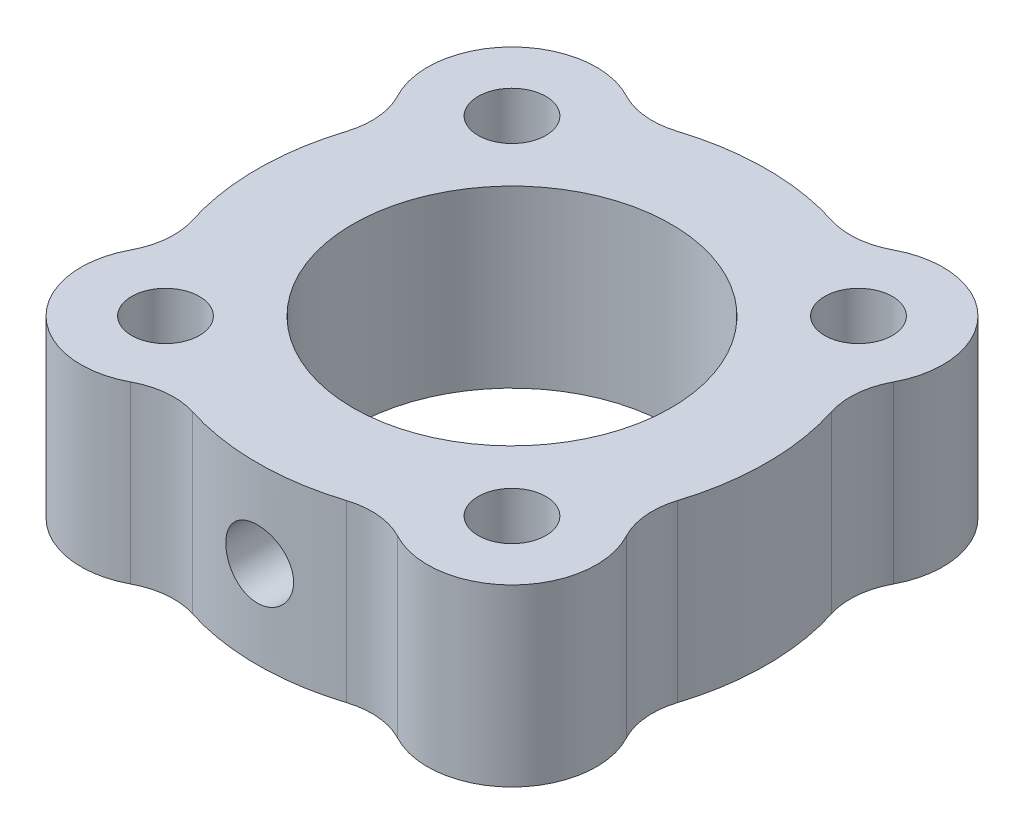
ISO-10303-21;
HEADER;
FILE_DESCRIPTION(('STEP AP214'),'2;1');
FILE_NAME('part.step','',(''),(''),'','','');
FILE_SCHEMA(('AUTOMOTIVE_DESIGN { 1 0 10303 214 1 1 1 1 }'));
ENDSEC;
DATA;
#1=APPLICATION_CONTEXT('core data for automotive mechanical design processes');
#2=APPLICATION_PROTOCOL_DEFINITION('international standard','automotive_design',2000,#1);
#3=PRODUCT_CONTEXT('',#1,'mechanical');
#4=PRODUCT('Part','Part','',(#3));
#5=PRODUCT_RELATED_PRODUCT_CATEGORY('part','',(#4));
#6=PRODUCT_DEFINITION_FORMATION('','',#4);
#7=PRODUCT_DEFINITION_CONTEXT('part definition',#1,'design');
#8=PRODUCT_DEFINITION('design','',#6,#7);
#9=PRODUCT_DEFINITION_SHAPE('','',#8);
#10=(LENGTH_UNIT() NAMED_UNIT(*) SI_UNIT(.MILLI.,.METRE.));
#11=(NAMED_UNIT(*) PLANE_ANGLE_UNIT() SI_UNIT($,.RADIAN.));
#12=(NAMED_UNIT(*) SI_UNIT($,.STERADIAN.) SOLID_ANGLE_UNIT());
#13=UNCERTAINTY_MEASURE_WITH_UNIT(LENGTH_MEASURE(1.E-05),#10,'distance_accuracy_value','');
#14=(GEOMETRIC_REPRESENTATION_CONTEXT(3) GLOBAL_UNCERTAINTY_ASSIGNED_CONTEXT((#13)) GLOBAL_UNIT_ASSIGNED_CONTEXT((#10,
#11,#12)) REPRESENTATION_CONTEXT('',''));
#15=CARTESIAN_POINT('',(0.,0.,0.));
#16=DIRECTION('',(0.,0.,1.));
#17=DIRECTION('',(1.,0.,0.));
#18=AXIS2_PLACEMENT_3D('',#15,#16,#17);
#19=CARTESIAN_POINT('',(3.95529126321616,9.525,-12.4686900684525));
#20=DIRECTION('',(0.,1.,0.));
#21=DIRECTION('',(0.,0.,1.));
#22=AXIS2_PLACEMENT_3D('',#19,#20,#21);
#23=CYLINDRICAL_SURFACE('',#22,2.921);
#24=CARTESIAN_POINT('',(3.95529126321616,2.54,-12.4686900684525));
#25=DIRECTION('',(0.,1.,0.));
#26=DIRECTION('',(0.,0.,1.));
#27=AXIS2_PLACEMENT_3D('',#24,#25,#26);
#28=CIRCLE('',#27,2.921);
#29=CARTESIAN_POINT('',(5.32895061805771,2.54,-9.89084193932303));
#30=VERTEX_POINT('',#29);
#31=CARTESIAN_POINT('',(3.07207088405138,2.54,-9.68441947064272));
#32=VERTEX_POINT('',#31);
#33=EDGE_CURVE('E127',#30,#32,#28,.F.);
#34=ORIENTED_EDGE('',*,*,#33,.T.);
#35=DIRECTION('',(0.,-1.,0.));
#36=VECTOR('',#35,1.);
#37=CARTESIAN_POINT('',(3.07207088405138,9.525,-9.68441947064272));
#38=LINE('',#37,#36);
#39=CARTESIAN_POINT('',(3.07207088405138,9.525,-9.68441947064272));
#40=VERTEX_POINT('',#39);
#41=EDGE_CURVE('E149',#40,#32,#38,.T.);
#42=ORIENTED_EDGE('',*,*,#41,.F.);
#43=CARTESIAN_POINT('',(3.95529126321616,9.525,-12.4686900684525));
#44=DIRECTION('',(0.,1.,0.));
#45=DIRECTION('',(0.,0.,1.));
#46=AXIS2_PLACEMENT_3D('',#43,#44,#45);
#47=CIRCLE('',#46,2.921);
#48=CARTESIAN_POINT('',(5.32895061805771,9.525,-9.89084193932303));
#49=VERTEX_POINT('',#48);
#50=EDGE_CURVE('E20',#49,#40,#47,.F.);
#51=ORIENTED_EDGE('',*,*,#50,.F.);
#52=DIRECTION('',(0.,-1.,0.));
#53=VECTOR('',#52,1.);
#54=CARTESIAN_POINT('',(5.32895061805771,9.525,-9.89084193932303));
#55=LINE('',#54,#53);
#56=EDGE_CURVE('E145',#30,#49,#55,.F.);
#57=ORIENTED_EDGE('',*,*,#56,.F.);
#58=EDGE_LOOP('',(#34,#42,#51,#57));
#59=FACE_BOUND('',#58,.T.);
#60=ADVANCED_FACE('F17',(#59),#23,.F.);
#61=CARTESIAN_POINT('',(-3.95529126321607,9.525,-12.4686900684525));
#62=DIRECTION('',(0.,1.,0.));
#63=DIRECTION('',(0.,0.,1.));
#64=AXIS2_PLACEMENT_3D('',#61,#62,#63);
#65=CYLINDRICAL_SURFACE('',#64,2.921);
#66=CARTESIAN_POINT('',(-3.95529126321607,2.54,-12.4686900684525));
#67=DIRECTION('',(0.,1.,0.));
#68=DIRECTION('',(0.,0.,1.));
#69=AXIS2_PLACEMENT_3D('',#66,#67,#68);
#70=CIRCLE('',#69,2.921);
#71=CARTESIAN_POINT('',(-3.07207088405131,2.54,-9.68441947064274));
#72=VERTEX_POINT('',#71);
#73=CARTESIAN_POINT('',(-5.32895061805764,2.54,-9.89084193932307));
#74=VERTEX_POINT('',#73);
#75=EDGE_CURVE('E140',#72,#74,#70,.F.);
#76=ORIENTED_EDGE('',*,*,#75,.T.);
#77=DIRECTION('',(0.,-1.,0.));
#78=VECTOR('',#77,1.);
#79=CARTESIAN_POINT('',(-5.32895061805764,9.525,-9.89084193932307));
#80=LINE('',#79,#78);
#81=CARTESIAN_POINT('',(-5.32895061805764,9.525,-9.89084193932307));
#82=VERTEX_POINT('',#81);
#83=EDGE_CURVE('E159',#82,#74,#80,.T.);
#84=ORIENTED_EDGE('',*,*,#83,.F.);
#85=CARTESIAN_POINT('',(-3.95529126321607,9.525,-12.4686900684525));
#86=DIRECTION('',(0.,1.,0.));
#87=DIRECTION('',(0.,0.,1.));
#88=AXIS2_PLACEMENT_3D('',#85,#86,#87);
#89=CIRCLE('',#88,2.921);
#90=CARTESIAN_POINT('',(-3.07207088405131,9.525,-9.68441947064274));
#91=VERTEX_POINT('',#90);
#92=EDGE_CURVE('E155',#91,#82,#89,.F.);
#93=ORIENTED_EDGE('',*,*,#92,.F.);
#94=DIRECTION('',(0.,-1.,0.));
#95=VECTOR('',#94,1.);
#96=CARTESIAN_POINT('',(-3.07207088405131,9.525,-9.68441947064274));
#97=LINE('',#96,#95);
#98=EDGE_CURVE('E327',#72,#91,#97,.F.);
#99=ORIENTED_EDGE('',*,*,#98,.F.);
#100=EDGE_LOOP('',(#76,#84,#93,#99));
#101=FACE_BOUND('',#100,.T.);
#102=ADVANCED_FACE('F325',(#101),#65,.F.);
#103=CARTESIAN_POINT('',(0.,6.0325,16.0437246383462));
#104=DIRECTION('',(0.,0.,1.));
#105=DIRECTION('',(1.,0.,0.));
#106=AXIS2_PLACEMENT_3D('',#103,#104,#105);
#107=CYLINDRICAL_SURFACE('',#106,1.35254999999999);
#108=CARTESIAN_POINT('',(0.,4.67995000000001,6.35));
#109=CARTESIAN_POINT('',(-0.0750471632780745,4.6799532589871,6.34999829109687));
#110=CARTESIAN_POINT('',(-0.150139225773979,4.68621853679149,6.34865568372771));
#111=CARTESIAN_POINT('',(-0.298207587506286,4.7110949818298,6.34342787909007));
#112=CARTESIAN_POINT('',(-0.371181675492682,4.7297185996608,6.33954011772078));
#113=CARTESIAN_POINT('',(-0.512832672049907,4.77870465532042,6.32965554088966));
#114=CARTESIAN_POINT('',(-0.581514247990421,4.80905407597117,6.32366106482182));
#115=CARTESIAN_POINT('',(-0.712800979699376,4.88059035043475,6.31021197910681));
#116=CARTESIAN_POINT('',(-0.775406879134115,4.92177587560618,6.30275754849689));
#117=CARTESIAN_POINT('',(-0.893727315084872,5.0144784654808,6.28707929813411));
#118=CARTESIAN_POINT('',(-0.949336446360758,5.0661285319522,6.27884638666341));
#119=CARTESIAN_POINT('',(-1.0511829388724,5.17802325922656,6.26260178305249));
#120=CARTESIAN_POINT('',(-1.09741749589304,5.23827048254082,6.25459015772276));
#121=CARTESIAN_POINT('',(-1.17966560546841,5.36643528003854,6.23960420880289));
#122=CARTESIAN_POINT('',(-1.2155628474068,5.43442896799417,6.23264207983407));
#123=CARTESIAN_POINT('',(-1.27534569830807,5.57561100854799,6.22068577239738));
#124=CARTESIAN_POINT('',(-1.29924508000965,5.64879329429422,6.21568933887547));
#125=CARTESIAN_POINT('',(-1.32864485681445,5.7740471277311,6.20945592466184));
#126=CARTESIAN_POINT('',(-1.33759487751569,5.82530106900315,6.20752588640034));
#127=CARTESIAN_POINT('',(-1.34954851058921,5.92852948877454,6.20493802773311));
#128=CARTESIAN_POINT('',(-1.35255227139075,5.98050394925582,6.20428017557135));
#129=CARTESIAN_POINT('',(-1.35254672259664,6.10752541368542,6.20428332563408));
#130=CARTESIAN_POINT('',(-1.34628495311372,6.18259577781737,6.20565750442881));
#131=CARTESIAN_POINT('',(-1.32142371189653,6.33061902207717,6.21099786105029));
#132=CARTESIAN_POINT('',(-1.30281171474536,6.40356967394338,6.21496667025208));
#133=CARTESIAN_POINT('',(-1.25385962676297,6.54517105269494,6.22502656373011));
#134=CARTESIAN_POINT('',(-1.22353309323969,6.61382664394816,6.23111519392307));
#135=CARTESIAN_POINT('',(-1.15205077466362,6.74506952506914,6.24472551077555));
#136=CARTESIAN_POINT('',(-1.11089626418825,6.807657527976,6.25224702873897));
#137=CARTESIAN_POINT('',(-1.01822556566802,6.925996833922,6.26801017783935));
#138=CARTESIAN_POINT('',(-0.966569407081304,6.98163737225314,6.27626058029602));
#139=CARTESIAN_POINT('',(-0.85464914252519,7.08354487063349,6.29247694544632));
#140=CARTESIAN_POINT('',(-0.794382558376484,7.12980912277652,6.30044282542318));
#141=CARTESIAN_POINT('',(-0.666199521654662,7.21208934606242,6.31528943073259));
#142=CARTESIAN_POINT('',(-0.598210285392906,7.24799418047066,6.32215805899767));
#143=CARTESIAN_POINT('',(-0.457037809009936,7.30779234051453,6.33392551804752));
#144=CARTESIAN_POINT('',(-0.383860587678284,7.33169933327395,6.33882658886009));
#145=CARTESIAN_POINT('',(-0.25858669301004,7.36111996252865,6.34493589793465));
#146=CARTESIAN_POINT('',(-0.207305867328812,7.37007937034924,6.3468254025267));
#147=CARTESIAN_POINT('',(-0.104023875136135,7.38204545024711,6.3493580315433));
#148=CARTESIAN_POINT('',(-0.0520227252073442,7.38505225913122,6.35000118461237));
#149=CARTESIAN_POINT('',(0.0750471632780732,7.3850467410129,6.34999829109687));
#150=CARTESIAN_POINT('',(0.150139225773978,7.37878146320851,6.34865568372771));
#151=CARTESIAN_POINT('',(0.298207587506285,7.3539050181702,6.34342787909007));
#152=CARTESIAN_POINT('',(0.371181675492681,7.3352814003392,6.33954011772078));
#153=CARTESIAN_POINT('',(0.512832672049906,7.28629534467958,6.32965554088966));
#154=CARTESIAN_POINT('',(0.58151424799042,7.25594592402883,6.32366106482182));
#155=CARTESIAN_POINT('',(0.712800979699375,7.18440964956525,6.31021197910681));
#156=CARTESIAN_POINT('',(0.775406879134114,7.14322412439382,6.30275754849689));
#157=CARTESIAN_POINT('',(0.893727315084872,7.0505215345192,6.28707929813411));
#158=CARTESIAN_POINT('',(0.949336446360758,6.9988714680478,6.27884638666341));
#159=CARTESIAN_POINT('',(1.0511829388724,6.88697674077344,6.26260178305249));
#160=CARTESIAN_POINT('',(1.09741749589304,6.82672951745918,6.25459015772276));
#161=CARTESIAN_POINT('',(1.17966560546841,6.69856471996146,6.23960420880289));
#162=CARTESIAN_POINT('',(1.2155628474068,6.63057103200583,6.23264207983407));
#163=CARTESIAN_POINT('',(1.27534569830807,6.48938899145201,6.22068577239738));
#164=CARTESIAN_POINT('',(1.29924508000965,6.41620670570578,6.21568933887547));
#165=CARTESIAN_POINT('',(1.32864485681445,6.2909528722689,6.20945592466184));
#166=CARTESIAN_POINT('',(1.33759487751569,6.23969893099684,6.20752588640034));
#167=CARTESIAN_POINT('',(1.34954851058921,6.13647051122545,6.20493802773311));
#168=CARTESIAN_POINT('',(1.35255227139075,6.08449605074417,6.20428017557135));
#169=CARTESIAN_POINT('',(1.35254672259664,5.95747458631458,6.20428332563408));
#170=CARTESIAN_POINT('',(1.34628495311372,5.88240422218263,6.20565750442881));
#171=CARTESIAN_POINT('',(1.32142371189653,5.73438097792283,6.21099786105029));
#172=CARTESIAN_POINT('',(1.30281171474536,5.66143032605662,6.21496667025208));
#173=CARTESIAN_POINT('',(1.25385962676297,5.51982894730506,6.22502656373011));
#174=CARTESIAN_POINT('',(1.22353309323969,5.45117335605184,6.23111519392307));
#175=CARTESIAN_POINT('',(1.15205077466361,5.31993047493086,6.24472551077555));
#176=CARTESIAN_POINT('',(1.11089626418825,5.257342472024,6.25224702873897));
#177=CARTESIAN_POINT('',(1.01822556566802,5.139003166078,6.26801017783935));
#178=CARTESIAN_POINT('',(0.966569407081304,5.08336262774686,6.27626058029602));
#179=CARTESIAN_POINT('',(0.85464914252519,4.98145512936651,6.29247694544632));
#180=CARTESIAN_POINT('',(0.794382558376484,4.93519087722348,6.30044282542318));
#181=CARTESIAN_POINT('',(0.666199521654662,4.85291065393758,6.31528943073259));
#182=CARTESIAN_POINT('',(0.598210285392906,4.81700581952934,6.32215805899767));
#183=CARTESIAN_POINT('',(0.457037809009936,4.75720765948547,6.33392551804752));
#184=CARTESIAN_POINT('',(0.383860587678284,4.73330066672605,6.33882658886009));
#185=CARTESIAN_POINT('',(0.258586693010039,4.70388003747135,6.34493589793465));
#186=CARTESIAN_POINT('',(0.207305867328812,4.69492062965076,6.3468254025267));
#187=CARTESIAN_POINT('',(0.104023875136134,4.68295454975289,6.3493580315433));
#188=CARTESIAN_POINT('',(0.052022725207343,4.67994774086878,6.35000118461237));
#189=CARTESIAN_POINT('',(0.,4.67995000000001,6.35));
#190=B_SPLINE_CURVE_WITH_KNOTS('',3,(#108,#109,#110,#111,#112,#113,#114,#115,#116,#117,#118,
#119,#120,#121,#122,#123,#124,#125,#126,#127,#128,#129,#130,#131,#132,#133,#134,#135,#136,#137,
#138,#139,#140,#141,#142,#143,#144,#145,#146,#147,#148,#149,#150,#151,#152,#153,#154,#155,#156,
#157,#158,#159,#160,#161,#162,#163,#164,#165,#166,#167,#168,#169,#170,#171,#172,#173,#174,#175,
#176,#177,#178,#179,#180,#181,#182,#183,#184,#185,#186,#187,#188,#189),.UNSPECIFIED.,.T.,.F.,(4,
2,2,2,2,2,2,2,2,2,2,2,2,2,2,2,2,2,2,2,2,2,2,2,2,2,2,2,2,2,2,2,2,2,2,2,2,2,2,2,4),(0.,
0.224949651136508,0.450126275982427,0.675053640209087,0.89995343838087,1.12791457201256,
1.35594379535309,1.58644652365364,1.81668404174771,1.97254305087209,2.12839816942854,
2.35328245539517,2.57839516495519,2.80324812692264,3.02807463294261,3.25612140277907,
3.48423393980881,3.71470970277065,3.94492232410781,4.1008611010001,4.25679629395604,
4.48174594509254,4.70692256993846,4.93184993416512,5.15674973233691,5.38471086596859,
5.61274008930912,5.84324281760967,6.07348033570375,6.22933934482812,6.38519446338458,
6.6100787493512,6.83519145891123,7.06004442087868,7.28487092689865,7.51291769673511,
7.74103023376484,7.97150599672669,8.20171861806385,8.35765739495613,8.51359258791207),.UNSPECIFIED.);
#191=CARTESIAN_POINT('',(0.,4.67995000000001,6.35));
#192=VERTEX_POINT('',#191);
#193=EDGE_CURVE('E139',#192,#192,#190,.T.);
#194=ORIENTED_EDGE('',*,*,#193,.T.);
#195=EDGE_LOOP('',(#194));
#196=FACE_BOUND('',#195,.T.);
#197=CARTESIAN_POINT('',(-1.35254999999999,6.0325,10.0695684365071));
#198=CARTESIAN_POINT('',(-1.3525466433626,6.10804129077537,10.0695696030717));
#199=CARTESIAN_POINT('',(-1.34619496016697,6.1836811159926,10.0704283580021));
#200=CARTESIAN_POINT('',(-1.32094489737387,6.33290614483726,10.0737709299998));
#201=CARTESIAN_POINT('',(-1.30202052621519,6.40648676237758,10.076258113368));
#202=CARTESIAN_POINT('',(-1.25219321734101,6.54933206190426,10.0825710232932));
#203=CARTESIAN_POINT('',(-1.22130353866668,6.61860142302363,10.0863952677658));
#204=CARTESIAN_POINT('',(-1.14844996295379,6.75094230979367,10.0949492946446));
#205=CARTESIAN_POINT('',(-1.1064905782915,6.81401634651805,10.0996787078592));
#206=CARTESIAN_POINT('',(-1.01239595918498,6.93261560865918,10.1095449249491));
#207=CARTESIAN_POINT('',(-0.960203544964528,6.98809529528744,10.1146839169908));
#208=CARTESIAN_POINT('',(-0.847245329726265,7.08953844573274,10.1247708328173));
#209=CARTESIAN_POINT('',(-0.786478659992263,7.1355009441329,10.1297187371769));
#210=CARTESIAN_POINT('',(-0.657817049082745,7.21676292160259,10.1388877742408));
#211=CARTESIAN_POINT('',(-0.58989629246305,7.25202186869218,10.1431061189586));
#212=CARTESIAN_POINT('',(-0.449032380940739,7.31061565938191,10.1503171312777));
#213=CARTESIAN_POINT('',(-0.376089480454125,7.33395110650916,10.1533098609138));
#214=CARTESIAN_POINT('',(-0.227710103177067,7.36790161554122,10.1577173481932));
#215=CARTESIAN_POINT('',(-0.152290971340383,7.37859126286711,10.1591413547638));
#216=CARTESIAN_POINT('',(-0.000716694266708818,7.38717800982287,10.1602825704962));
#217=CARTESIAN_POINT('',(0.075438419490393,7.38507565420379,10.1599998523392));
#218=CARTESIAN_POINT('',(0.225814183981001,7.36819760265153,10.1577669310844));
#219=CARTESIAN_POINT('',(0.300044030647495,7.35350224244173,10.1558272983419));
#220=CARTESIAN_POINT('',(0.444975242926539,7.31198084576055,10.1505102907647));
#221=CARTESIAN_POINT('',(0.515676503232885,7.28515444749373,10.1471328730497));
#222=CARTESIAN_POINT('',(0.651792135147238,7.22004698752602,10.1393014379308));
#223=CARTESIAN_POINT('',(0.71718963830435,7.18173106938673,10.1348441524857));
#224=CARTESIAN_POINT('',(0.840651601616256,7.09476088881498,10.1253515690495));
#225=CARTESIAN_POINT('',(0.898716268742608,7.04610691828126,10.1203162873803));
#226=CARTESIAN_POINT('',(1.00633250283049,6.9394022633579,10.110185175493));
#227=CARTESIAN_POINT('',(1.05581636189935,6.88128329266289,10.1050891753627));
#228=CARTESIAN_POINT('',(1.1443606283527,6.75749789328382,10.0954459962191));
#229=CARTESIAN_POINT('',(1.18341627360554,6.69182803594011,10.0908990684619));
#230=CARTESIAN_POINT('',(1.24999706842667,6.55472413700911,10.0828685400337));
#231=CARTESIAN_POINT('',(1.27750677453373,6.48328252657256,10.0793863652188));
#232=CARTESIAN_POINT('',(1.32006262264727,6.33683289868014,10.0739020332904));
#233=CARTESIAN_POINT('',(1.33513515214115,6.26183279079247,10.0718967437024));
#234=CARTESIAN_POINT('',(1.34670868483606,6.16067794129029,10.0703515224735));
#235=CARTESIAN_POINT('',(1.34889750231266,6.13509536629075,10.0700584793415));
#236=CARTESIAN_POINT('',(1.35181873076691,6.08384565611841,10.069666738036));
#237=CARTESIAN_POINT('',(1.35255114101152,6.05817852090305,10.0695680399604));
#238=CARTESIAN_POINT('',(1.3525466433626,5.95695870922463,10.0695696030717));
#239=CARTESIAN_POINT('',(1.34619496016698,5.8813188840074,10.0704283580021));
#240=CARTESIAN_POINT('',(1.32094489737387,5.73209385516274,10.0737709299998));
#241=CARTESIAN_POINT('',(1.30202052621519,5.65851323762242,10.076258113368));
#242=CARTESIAN_POINT('',(1.25219321734101,5.51566793809574,10.0825710232932));
#243=CARTESIAN_POINT('',(1.22130353866668,5.44639857697637,10.0863952677658));
#244=CARTESIAN_POINT('',(1.14844996295379,5.31405769020633,10.0949492946446));
#245=CARTESIAN_POINT('',(1.1064905782915,5.25098365348195,10.0996787078592));
#246=CARTESIAN_POINT('',(1.01239595918498,5.13238439134082,10.1095449249491));
#247=CARTESIAN_POINT('',(0.960203544964528,5.07690470471255,10.1146839169908));
#248=CARTESIAN_POINT('',(0.847245329726265,4.97546155426726,10.1247708328173));
#249=CARTESIAN_POINT('',(0.786478659992263,4.9294990558671,10.1297187371769));
#250=CARTESIAN_POINT('',(0.657817049082745,4.84823707839741,10.1388877742408));
#251=CARTESIAN_POINT('',(0.58989629246305,4.81297813130782,10.1431061189586));
#252=CARTESIAN_POINT('',(0.449032380940739,4.75438434061809,10.1503171312777));
#253=CARTESIAN_POINT('',(0.376089480454125,4.73104889349084,10.1533098609138));
#254=CARTESIAN_POINT('',(0.227710103177067,4.69709838445877,10.1577173481932));
#255=CARTESIAN_POINT('',(0.152290971340383,4.68640873713289,10.1591413547638));
#256=CARTESIAN_POINT('',(0.000716694266708804,4.67782199017713,10.1602825704962));
#257=CARTESIAN_POINT('',(-0.0754384194903931,4.67992434579621,10.1599998523392));
#258=CARTESIAN_POINT('',(-0.225814183981001,4.69680239734847,10.1577669310844));
#259=CARTESIAN_POINT('',(-0.300044030647494,4.71149775755827,10.1558272983419));
#260=CARTESIAN_POINT('',(-0.444975242926539,4.75301915423945,10.1505102907647));
#261=CARTESIAN_POINT('',(-0.515676503232885,4.77984555250627,10.1471328730497));
#262=CARTESIAN_POINT('',(-0.651792135147237,4.84495301247398,10.1393014379308));
#263=CARTESIAN_POINT('',(-0.717189638304349,4.88326893061326,10.1348441524857));
#264=CARTESIAN_POINT('',(-0.840651601616255,4.97023911118502,10.1253515690495));
#265=CARTESIAN_POINT('',(-0.898716268742608,5.01889308171874,10.1203162873803));
#266=CARTESIAN_POINT('',(-1.00633250283049,5.1255977366421,10.110185175493));
#267=CARTESIAN_POINT('',(-1.05581636189935,5.18371670733711,10.1050891753627));
#268=CARTESIAN_POINT('',(-1.1443606283527,5.30750210671618,10.0954459962191));
#269=CARTESIAN_POINT('',(-1.18341627360554,5.37317196405989,10.0908990684619));
#270=CARTESIAN_POINT('',(-1.24999706842667,5.51027586299089,10.0828685400337));
#271=CARTESIAN_POINT('',(-1.27750677453373,5.58171747342744,10.0793863652188));
#272=CARTESIAN_POINT('',(-1.32006262264727,5.72816710131986,10.0739020332904));
#273=CARTESIAN_POINT('',(-1.33513515214115,5.80316720920753,10.0718967437024));
#274=CARTESIAN_POINT('',(-1.34670868483606,5.90432205870971,10.0703515224735));
#275=CARTESIAN_POINT('',(-1.34889750231266,5.92990463370925,10.0700584793415));
#276=CARTESIAN_POINT('',(-1.35181873076691,5.98115434388159,10.069666738036));
#277=CARTESIAN_POINT('',(-1.35255114101152,6.00682147909694,10.0695680399604));
#278=CARTESIAN_POINT('',(-1.35254999999999,6.0325,10.0695684365071));
#279=B_SPLINE_CURVE_WITH_KNOTS('',3,(#197,#198,#199,#200,#201,#202,#203,#204,#205,#206,#207,
#208,#209,#210,#211,#212,#213,#214,#215,#216,#217,#218,#219,#220,#221,#222,#223,#224,#225,#226,
#227,#228,#229,#230,#231,#232,#233,#234,#235,#236,#237,#238,#239,#240,#241,#242,#243,#244,#245,
#246,#247,#248,#249,#250,#251,#252,#253,#254,#255,#256,#257,#258,#259,#260,#261,#262,#263,#264,
#265,#266,#267,#268,#269,#270,#271,#272,#273,#274,#275,#276,#277,#278),.UNSPECIFIED.,.T.,.F.,(4,
2,2,2,2,2,2,2,2,2,2,2,2,2,2,2,2,2,2,2,2,2,2,2,2,2,2,2,2,2,2,2,2,2,2,2,2,2,2,2,4),(0.,
0.226525967744277,0.453521696691511,0.680266602572222,0.906919222202868,1.13487640202074,
1.36285669433833,1.59168982728675,1.82051137633063,2.04797648938659,2.27543191584451,
2.50144702576443,2.72746887679152,2.95418348295414,3.18089168859618,3.40931453853703,
3.63784152198352,3.86667320875668,4.09501813450168,4.17202037804741,4.24902266035025,
4.47554862809453,4.70254435704176,4.92928926292247,5.15594188255312,5.38389906237099,
5.61187935468859,5.840712487637,6.06953403668088,6.29699914973684,6.52445457619476,
6.75046968611468,6.97649153714178,7.20320614330439,7.42991434894644,7.65833719888728,
7.88686418233377,8.11569586910693,8.34404079485193,8.42104303839766,8.4980453207005),.UNSPECIFIED.);
#280=CARTESIAN_POINT('',(-1.35254999999999,6.0325,10.0695684365071));
#281=VERTEX_POINT('',#280);
#282=EDGE_CURVE('E232',#281,#281,#279,.T.);
#283=ORIENTED_EDGE('',*,*,#282,.F.);
#284=EDGE_LOOP('',(#283));
#285=FACE_BOUND('',#284,.T.);
#286=ADVANCED_FACE('F242',(#196,#285),#107,.F.);
#287=CARTESIAN_POINT('',(-3.45739860661162,2.54,-3.45739860661163));
#288=DIRECTION('',(0.,1.,0.));
#289=DIRECTION('',(0.,0.,1.));
#290=AXIS2_PLACEMENT_3D('',#287,#288,#289);
#291=PLANE('',#290);
#292=CARTESIAN_POINT('',(0.,2.54,0.));
#293=DIRECTION('',(0.,1.,0.));
#294=DIRECTION('',(0.,0.,1.));
#295=AXIS2_PLACEMENT_3D('',#292,#293,#294);
#296=CIRCLE('',#295,6.35);
#297=CARTESIAN_POINT('',(0.,2.54,6.35));
#298=VERTEX_POINT('',#297);
#299=EDGE_CURVE('E308',#298,#298,#296,.T.);
#300=ORIENTED_EDGE('',*,*,#299,.T.);
#301=EDGE_LOOP('',(#300));
#302=FACE_BOUND('',#301,.T.);
#303=ORIENTED_EDGE('',*,*,#33,.F.);
#304=CARTESIAN_POINT('',(6.91479721322328,2.54,-6.91479721322321));
#305=DIRECTION('',(0.,-1.,0.));
#306=DIRECTION('',(0.,0.,-1.));
#307=AXIS2_PLACEMENT_3D('',#304,#305,#306);
#308=CIRCLE('',#307,3.37220278677674);
#309=CARTESIAN_POINT('',(9.89084193932309,2.54,-5.32895061805761));
#310=VERTEX_POINT('',#309);
#311=EDGE_CURVE('E131',#310,#30,#308,.F.);
#312=ORIENTED_EDGE('',*,*,#311,.F.);
#313=CARTESIAN_POINT('',(12.4686900684525,2.54,-3.95529126321602));
#314=DIRECTION('',(0.,1.,0.));
#315=DIRECTION('',(0.,0.,1.));
#316=AXIS2_PLACEMENT_3D('',#313,#314,#315);
#317=CIRCLE('',#316,2.921);
#318=CARTESIAN_POINT('',(9.68441947064275,2.54,-3.07207088405128));
#319=VERTEX_POINT('',#318);
#320=EDGE_CURVE('E213',#310,#319,#317,.T.);
#321=ORIENTED_EDGE('',*,*,#320,.T.);
#322=CARTESIAN_POINT('',(0.,2.54,0.));
#323=DIRECTION('',(0.,-1.,0.));
#324=DIRECTION('',(0.,0.,-1.));
#325=AXIS2_PLACEMENT_3D('',#322,#323,#324);
#326=CIRCLE('',#325,10.16);
#327=CARTESIAN_POINT('',(9.68441947064269,2.54,3.07207088405145));
#328=VERTEX_POINT('',#327);
#329=EDGE_CURVE('E215',#328,#319,#326,.F.);
#330=ORIENTED_EDGE('',*,*,#329,.F.);
#331=CARTESIAN_POINT('',(12.4686900684525,2.54,3.95529126321624));
#332=DIRECTION('',(0.,1.,0.));
#333=DIRECTION('',(0.,0.,1.));
#334=AXIS2_PLACEMENT_3D('',#331,#332,#333);
#335=CIRCLE('',#334,2.921);
#336=CARTESIAN_POINT('',(9.89084193932299,2.54,5.32895061805778));
#337=VERTEX_POINT('',#336);
#338=EDGE_CURVE('E219',#328,#337,#335,.T.);
#339=ORIENTED_EDGE('',*,*,#338,.T.);
#340=CARTESIAN_POINT('',(6.91479721322319,2.54,6.91479721322331));
#341=DIRECTION('',(0.,-1.,0.));
#342=DIRECTION('',(0.,0.,-1.));
#343=AXIS2_PLACEMENT_3D('',#340,#341,#342);
#344=CIRCLE('',#343,3.3722027867767);
#345=CARTESIAN_POINT('',(5.3289506180576,2.54,9.89084193932309));
#346=VERTEX_POINT('',#345);
#347=EDGE_CURVE('E221',#346,#337,#344,.F.);
#348=ORIENTED_EDGE('',*,*,#347,.F.);
#349=CARTESIAN_POINT('',(3.95529126321602,2.54,12.4686900684525));
#350=DIRECTION('',(0.,1.,0.));
#351=DIRECTION('',(0.,0.,1.));
#352=AXIS2_PLACEMENT_3D('',#349,#350,#351);
#353=CIRCLE('',#352,2.921);
#354=CARTESIAN_POINT('',(3.07207088405128,2.54,9.68441947064275));
#355=VERTEX_POINT('',#354);
#356=EDGE_CURVE('E225',#346,#355,#353,.T.);
#357=ORIENTED_EDGE('',*,*,#356,.T.);
#358=CARTESIAN_POINT('',(0.,2.54,0.));
#359=DIRECTION('',(0.,-1.,0.));
#360=DIRECTION('',(0.,0.,-1.));
#361=AXIS2_PLACEMENT_3D('',#358,#359,#360);
#362=CIRCLE('',#361,10.16);
#363=CARTESIAN_POINT('',(-3.0720708840515,2.54,9.68441947064268));
#364=VERTEX_POINT('',#363);
#365=EDGE_CURVE('E229',#364,#355,#362,.F.);
#366=ORIENTED_EDGE('',*,*,#365,.F.);
#367=CARTESIAN_POINT('',(-3.95529126321631,2.54,12.4686900684524));
#368=DIRECTION('',(0.,1.,0.));
#369=DIRECTION('',(0.,0.,1.));
#370=AXIS2_PLACEMENT_3D('',#367,#368,#369);
#371=CIRCLE('',#370,2.921);
#372=CARTESIAN_POINT('',(-5.32895061805783,2.54,9.89084193932296));
#373=VERTEX_POINT('',#372);
#374=EDGE_CURVE('E240',#364,#373,#371,.T.);
#375=ORIENTED_EDGE('',*,*,#374,.T.);
#376=CARTESIAN_POINT('',(-6.91479721322333,2.54,6.91479721322316));
#377=DIRECTION('',(0.,-1.,0.));
#378=DIRECTION('',(0.,0.,-1.));
#379=AXIS2_PLACEMENT_3D('',#376,#377,#378);
#380=CIRCLE('',#379,3.37220278677669);
#381=CARTESIAN_POINT('',(-9.89084193932309,2.54,5.32895061805759));
#382=VERTEX_POINT('',#381);
#383=EDGE_CURVE('E398',#382,#373,#380,.F.);
#384=ORIENTED_EDGE('',*,*,#383,.F.);
#385=CARTESIAN_POINT('',(-12.4686900684525,2.54,3.955291263216));
#386=DIRECTION('',(0.,1.,0.));
#387=DIRECTION('',(0.,0.,1.));
#388=AXIS2_PLACEMENT_3D('',#385,#386,#387);
#389=CIRCLE('',#388,2.921);
#390=CARTESIAN_POINT('',(-9.68441947064275,2.54,3.07207088405127));
#391=VERTEX_POINT('',#390);
#392=EDGE_CURVE('E401',#382,#391,#389,.T.);
#393=ORIENTED_EDGE('',*,*,#392,.T.);
#394=CARTESIAN_POINT('',(0.,2.54,0.));
#395=DIRECTION('',(0.,-1.,0.));
#396=DIRECTION('',(0.,0.,-1.));
#397=AXIS2_PLACEMENT_3D('',#394,#395,#396);
#398=CIRCLE('',#397,10.16);
#399=CARTESIAN_POINT('',(-9.68441947064273,2.54,-3.07207088405135));
#400=VERTEX_POINT('',#399);
#401=EDGE_CURVE('E405',#400,#391,#398,.F.);
#402=ORIENTED_EDGE('',*,*,#401,.F.);
#403=CARTESIAN_POINT('',(-12.4686900684525,2.54,-3.95529126321611));
#404=DIRECTION('',(0.,1.,0.));
#405=DIRECTION('',(0.,0.,1.));
#406=AXIS2_PLACEMENT_3D('',#403,#404,#405);
#407=CIRCLE('',#406,2.921);
#408=CARTESIAN_POINT('',(-9.89084193932305,2.54,-5.32895061805768));
#409=VERTEX_POINT('',#408);
#410=EDGE_CURVE('E330',#400,#409,#407,.T.);
#411=ORIENTED_EDGE('',*,*,#410,.T.);
#412=CARTESIAN_POINT('',(-6.91479721322324,2.54,-6.91479721322326));
#413=DIRECTION('',(0.,-1.,0.));
#414=DIRECTION('',(0.,0.,-1.));
#415=AXIS2_PLACEMENT_3D('',#412,#413,#414);
#416=CIRCLE('',#415,3.37220278677674);
#417=EDGE_CURVE('E328',#74,#409,#416,.F.);
#418=ORIENTED_EDGE('',*,*,#417,.F.);
#419=ORIENTED_EDGE('',*,*,#75,.F.);
#420=CARTESIAN_POINT('',(0.,2.54,0.));
#421=DIRECTION('',(0.,-1.,0.));
#422=DIRECTION('',(0.,0.,-1.));
#423=AXIS2_PLACEMENT_3D('',#420,#421,#422);
#424=CIRCLE('',#423,10.16);
#425=EDGE_CURVE('E134',#32,#72,#424,.F.);
#426=ORIENTED_EDGE('',*,*,#425,.F.);
#427=EDGE_LOOP('',(#303,#312,#321,#330,#339,#348,#357,#366,#375,#384,#393,#402,#411,#418,#419,#426));
#428=FACE_BOUND('',#427,.T.);
#429=CARTESIAN_POINT('',(-6.91479721322324,2.54,-6.91479721322326));
#430=DIRECTION('',(0.,1.,0.));
#431=DIRECTION('',(0.,0.,1.));
#432=AXIS2_PLACEMENT_3D('',#429,#430,#431);
#433=CIRCLE('',#432,1.35254999999999);
#434=CARTESIAN_POINT('',(-6.91479721322324,2.54,-5.56224721322327));
#435=VERTEX_POINT('',#434);
#436=EDGE_CURVE('E150',#435,#435,#433,.T.);
#437=ORIENTED_EDGE('',*,*,#436,.T.);
#438=EDGE_LOOP('',(#437));
#439=FACE_BOUND('',#438,.T.);
#440=CARTESIAN_POINT('',(-6.91479721322323,2.54,6.91479721322326));
#441=DIRECTION('',(0.,1.,0.));
#442=DIRECTION('',(0.,0.,1.));
#443=AXIS2_PLACEMENT_3D('',#440,#441,#442);
#444=CIRCLE('',#443,1.35254999999999);
#445=CARTESIAN_POINT('',(-6.91479721322323,2.54,8.26734721322325));
#446=VERTEX_POINT('',#445);
#447=EDGE_CURVE('E338',#446,#446,#444,.T.);
#448=ORIENTED_EDGE('',*,*,#447,.T.);
#449=EDGE_LOOP('',(#448));
#450=FACE_BOUND('',#449,.T.);
#451=CARTESIAN_POINT('',(6.91479721322324,2.54,6.91479721322326));
#452=DIRECTION('',(0.,1.,0.));
#453=DIRECTION('',(0.,0.,1.));
#454=AXIS2_PLACEMENT_3D('',#451,#452,#453);
#455=CIRCLE('',#454,1.35254999999999);
#456=CARTESIAN_POINT('',(6.91479721322324,2.54,8.26734721322325));
#457=VERTEX_POINT('',#456);
#458=EDGE_CURVE('E341',#457,#457,#455,.T.);
#459=ORIENTED_EDGE('',*,*,#458,.T.);
#460=EDGE_LOOP('',(#459));
#461=FACE_BOUND('',#460,.T.);
#462=CARTESIAN_POINT('',(6.91479721322318,2.54,-6.91479721322331));
#463=DIRECTION('',(0.,1.,0.));
#464=DIRECTION('',(0.,0.,1.));
#465=AXIS2_PLACEMENT_3D('',#462,#463,#464);
#466=CIRCLE('',#465,1.35254999999999);
#467=CARTESIAN_POINT('',(6.91479721322318,2.54,-5.56224721322332));
#468=VERTEX_POINT('',#467);
#469=EDGE_CURVE('E343',#468,#468,#466,.T.);
#470=ORIENTED_EDGE('',*,*,#469,.T.);
#471=EDGE_LOOP('',(#470));
#472=FACE_BOUND('',#471,.T.);
#473=ADVANCED_FACE('F129',(#302,#428,#439,#450,#461,#472),#291,.F.);
#474=CARTESIAN_POINT('',(0.,9.525,0.));
#475=DIRECTION('',(0.,1.,0.));
#476=DIRECTION('',(0.,0.,1.));
#477=AXIS2_PLACEMENT_3D('',#474,#475,#476);
#478=CYLINDRICAL_SURFACE('',#477,6.35);
#479=ORIENTED_EDGE('',*,*,#193,.F.);
#480=EDGE_LOOP('',(#479));
#481=FACE_BOUND('',#480,.T.);
#482=CARTESIAN_POINT('',(0.,9.525,0.));
#483=DIRECTION('',(0.,1.,0.));
#484=DIRECTION('',(0.,0.,1.));
#485=AXIS2_PLACEMENT_3D('',#482,#483,#484);
#486=CIRCLE('',#485,6.35);
#487=CARTESIAN_POINT('',(0.,9.525,6.35));
#488=VERTEX_POINT('',#487);
#489=EDGE_CURVE('E210',#488,#488,#486,.F.);
#490=ORIENTED_EDGE('',*,*,#489,.F.);
#491=EDGE_LOOP('',(#490));
#492=FACE_BOUND('',#491,.T.);
#493=ORIENTED_EDGE('',*,*,#299,.F.);
#494=EDGE_LOOP('',(#493));
#495=FACE_BOUND('',#494,.T.);
#496=ADVANCED_FACE('F298',(#481,#492,#495),#478,.F.);
#497=CARTESIAN_POINT('',(6.91479721322318,9.525,-6.91479721322331));
#498=DIRECTION('',(0.,1.,0.));
#499=DIRECTION('',(0.,0.,1.));
#500=AXIS2_PLACEMENT_3D('',#497,#498,#499);
#501=CYLINDRICAL_SURFACE('',#500,1.35254999999999);
#502=CARTESIAN_POINT('',(6.91479721322318,9.525,-6.91479721322331));
#503=DIRECTION('',(0.,1.,0.));
#504=DIRECTION('',(0.,0.,1.));
#505=AXIS2_PLACEMENT_3D('',#502,#503,#504);
#506=CIRCLE('',#505,1.35254999999999);
#507=CARTESIAN_POINT('',(6.91479721322318,9.525,-5.56224721322332));
#508=VERTEX_POINT('',#507);
#509=EDGE_CURVE('E207',#508,#508,#506,.F.);
#510=ORIENTED_EDGE('',*,*,#509,.F.);
#511=EDGE_LOOP('',(#510));
#512=FACE_BOUND('',#511,.T.);
#513=ORIENTED_EDGE('',*,*,#469,.F.);
#514=EDGE_LOOP('',(#513));
#515=FACE_BOUND('',#514,.T.);
#516=ADVANCED_FACE('F294',(#512,#515),#501,.F.);
#517=CARTESIAN_POINT('',(6.91479721322324,9.525,6.91479721322326));
#518=DIRECTION('',(0.,1.,0.));
#519=DIRECTION('',(0.,0.,1.));
#520=AXIS2_PLACEMENT_3D('',#517,#518,#519);
#521=CYLINDRICAL_SURFACE('',#520,1.35254999999999);
#522=CARTESIAN_POINT('',(6.91479721322324,9.525,6.91479721322326));
#523=DIRECTION('',(0.,1.,0.));
#524=DIRECTION('',(0.,0.,1.));
#525=AXIS2_PLACEMENT_3D('',#522,#523,#524);
#526=CIRCLE('',#525,1.35254999999999);
#527=CARTESIAN_POINT('',(6.91479721322324,9.525,8.26734721322325));
#528=VERTEX_POINT('',#527);
#529=EDGE_CURVE('E204',#528,#528,#526,.F.);
#530=ORIENTED_EDGE('',*,*,#529,.F.);
#531=EDGE_LOOP('',(#530));
#532=FACE_BOUND('',#531,.T.);
#533=ORIENTED_EDGE('',*,*,#458,.F.);
#534=EDGE_LOOP('',(#533));
#535=FACE_BOUND('',#534,.T.);
#536=ADVANCED_FACE('F290',(#532,#535),#521,.F.);
#537=CARTESIAN_POINT('',(-6.91479721322323,9.525,6.91479721322326));
#538=DIRECTION('',(0.,1.,0.));
#539=DIRECTION('',(0.,0.,1.));
#540=AXIS2_PLACEMENT_3D('',#537,#538,#539);
#541=CYLINDRICAL_SURFACE('',#540,1.35254999999999);
#542=CARTESIAN_POINT('',(-6.91479721322323,9.525,6.91479721322326));
#543=DIRECTION('',(0.,1.,0.));
#544=DIRECTION('',(0.,0.,1.));
#545=AXIS2_PLACEMENT_3D('',#542,#543,#544);
#546=CIRCLE('',#545,1.35254999999999);
#547=CARTESIAN_POINT('',(-6.91479721322323,9.525,8.26734721322325));
#548=VERTEX_POINT('',#547);
#549=EDGE_CURVE('E201',#548,#548,#546,.F.);
#550=ORIENTED_EDGE('',*,*,#549,.F.);
#551=EDGE_LOOP('',(#550));
#552=FACE_BOUND('',#551,.T.);
#553=ORIENTED_EDGE('',*,*,#447,.F.);
#554=EDGE_LOOP('',(#553));
#555=FACE_BOUND('',#554,.T.);
#556=ADVANCED_FACE('F286',(#552,#555),#541,.F.);
#557=CARTESIAN_POINT('',(-6.91479721322324,9.525,-6.91479721322326));
#558=DIRECTION('',(0.,1.,0.));
#559=DIRECTION('',(0.,0.,1.));
#560=AXIS2_PLACEMENT_3D('',#557,#558,#559);
#561=CYLINDRICAL_SURFACE('',#560,1.35254999999999);
#562=CARTESIAN_POINT('',(-6.91479721322324,9.525,-6.91479721322326));
#563=DIRECTION('',(0.,1.,0.));
#564=DIRECTION('',(0.,0.,1.));
#565=AXIS2_PLACEMENT_3D('',#562,#563,#564);
#566=CIRCLE('',#565,1.35254999999999);
#567=CARTESIAN_POINT('',(-6.91479721322324,9.525,-5.56224721322327));
#568=VERTEX_POINT('',#567);
#569=EDGE_CURVE('E198',#568,#568,#566,.F.);
#570=ORIENTED_EDGE('',*,*,#569,.F.);
#571=EDGE_LOOP('',(#570));
#572=FACE_BOUND('',#571,.T.);
#573=ORIENTED_EDGE('',*,*,#436,.F.);
#574=EDGE_LOOP('',(#573));
#575=FACE_BOUND('',#574,.T.);
#576=ADVANCED_FACE('F283',(#572,#575),#561,.F.);
#577=CARTESIAN_POINT('',(6.91479721322328,9.525,-6.91479721322321));
#578=DIRECTION('',(0.,-1.,0.));
#579=DIRECTION('',(0.,0.,-1.));
#580=AXIS2_PLACEMENT_3D('',#577,#578,#579);
#581=CYLINDRICAL_SURFACE('',#580,3.37220278677674);
#582=DIRECTION('',(0.,1.,0.));
#583=VECTOR('',#582,1.);
#584=CARTESIAN_POINT('',(9.89084193932309,9.525,-5.32895061805761));
#585=LINE('',#584,#583);
#586=CARTESIAN_POINT('',(9.89084193932309,9.525,-5.32895061805761));
#587=VERTEX_POINT('',#586);
#588=EDGE_CURVE('E147',#587,#310,#585,.F.);
#589=ORIENTED_EDGE('',*,*,#588,.T.);
#590=ORIENTED_EDGE('',*,*,#311,.T.);
#591=ORIENTED_EDGE('',*,*,#56,.T.);
#592=CARTESIAN_POINT('',(6.91479721322328,9.525,-6.91479721322321));
#593=DIRECTION('',(0.,-1.,0.));
#594=DIRECTION('',(0.,0.,-1.));
#595=AXIS2_PLACEMENT_3D('',#592,#593,#594);
#596=CIRCLE('',#595,3.37220278677674);
#597=EDGE_CURVE('E196',#587,#49,#596,.F.);
#598=ORIENTED_EDGE('',*,*,#597,.F.);
#599=EDGE_LOOP('',(#589,#590,#591,#598));
#600=FACE_BOUND('',#599,.T.);
#601=ADVANCED_FACE('F144',(#600),#581,.T.);
#602=CARTESIAN_POINT('',(0.,9.525,0.));
#603=DIRECTION('',(0.,-1.,0.));
#604=DIRECTION('',(0.,0.,-1.));
#605=AXIS2_PLACEMENT_3D('',#602,#603,#604);
#606=CYLINDRICAL_SURFACE('',#605,10.16);
#607=ORIENTED_EDGE('',*,*,#425,.T.);
#608=ORIENTED_EDGE('',*,*,#98,.T.);
#609=CARTESIAN_POINT('',(0.,9.525,0.));
#610=DIRECTION('',(0.,-1.,0.));
#611=DIRECTION('',(0.,0.,-1.));
#612=AXIS2_PLACEMENT_3D('',#609,#610,#611);
#613=CIRCLE('',#612,10.16);
#614=EDGE_CURVE('E194',#40,#91,#613,.F.);
#615=ORIENTED_EDGE('',*,*,#614,.F.);
#616=ORIENTED_EDGE('',*,*,#41,.T.);
#617=EDGE_LOOP('',(#607,#608,#615,#616));
#618=FACE_BOUND('',#617,.T.);
#619=ADVANCED_FACE('F276',(#618),#606,.T.);
#620=CARTESIAN_POINT('',(-6.91479721322324,9.525,-6.91479721322326));
#621=DIRECTION('',(0.,-1.,0.));
#622=DIRECTION('',(0.,0.,-1.));
#623=AXIS2_PLACEMENT_3D('',#620,#621,#622);
#624=CYLINDRICAL_SURFACE('',#623,3.37220278677674);
#625=ORIENTED_EDGE('',*,*,#417,.T.);
#626=DIRECTION('',(0.,1.,0.));
#627=VECTOR('',#626,1.);
#628=CARTESIAN_POINT('',(-9.89084193932305,9.525,-5.32895061805768));
#629=LINE('',#628,#627);
#630=CARTESIAN_POINT('',(-9.89084193932305,9.525,-5.32895061805768));
#631=VERTEX_POINT('',#630);
#632=EDGE_CURVE('E323',#409,#631,#629,.T.);
#633=ORIENTED_EDGE('',*,*,#632,.T.);
#634=CARTESIAN_POINT('',(-6.91479721322324,9.525,-6.91479721322326));
#635=DIRECTION('',(0.,-1.,0.));
#636=DIRECTION('',(0.,0.,-1.));
#637=AXIS2_PLACEMENT_3D('',#634,#635,#636);
#638=CIRCLE('',#637,3.37220278677674);
#639=EDGE_CURVE('E191',#82,#631,#638,.F.);
#640=ORIENTED_EDGE('',*,*,#639,.F.);
#641=ORIENTED_EDGE('',*,*,#83,.T.);
#642=EDGE_LOOP('',(#625,#633,#640,#641));
#643=FACE_BOUND('',#642,.T.);
#644=ADVANCED_FACE('F272',(#643),#624,.T.);
#645=CARTESIAN_POINT('',(-12.4686900684525,9.525,-3.95529126321611));
#646=DIRECTION('',(0.,1.,0.));
#647=DIRECTION('',(0.,0.,1.));
#648=AXIS2_PLACEMENT_3D('',#645,#646,#647);
#649=CYLINDRICAL_SURFACE('',#648,2.921);
#650=ORIENTED_EDGE('',*,*,#632,.F.);
#651=ORIENTED_EDGE('',*,*,#410,.F.);
#652=DIRECTION('',(0.,-1.,0.));
#653=VECTOR('',#652,1.);
#654=CARTESIAN_POINT('',(-9.68441947064273,9.525,-3.07207088405134));
#655=LINE('',#654,#653);
#656=CARTESIAN_POINT('',(-9.68441947064273,9.525,-3.07207088405135));
#657=VERTEX_POINT('',#656);
#658=EDGE_CURVE('E402',#657,#400,#655,.T.);
#659=ORIENTED_EDGE('',*,*,#658,.F.);
#660=CARTESIAN_POINT('',(-12.4686900684525,9.525,-3.95529126321611));
#661=DIRECTION('',(0.,1.,0.));
#662=DIRECTION('',(0.,0.,1.));
#663=AXIS2_PLACEMENT_3D('',#660,#661,#662);
#664=CIRCLE('',#663,2.921);
#665=EDGE_CURVE('E188',#631,#657,#664,.F.);
#666=ORIENTED_EDGE('',*,*,#665,.F.);
#667=EDGE_LOOP('',(#650,#651,#659,#666));
#668=FACE_BOUND('',#667,.T.);
#669=ADVANCED_FACE('F268',(#668),#649,.F.);
#670=CARTESIAN_POINT('',(0.,9.525,0.));
#671=DIRECTION('',(0.,-1.,0.));
#672=DIRECTION('',(0.,0.,-1.));
#673=AXIS2_PLACEMENT_3D('',#670,#671,#672);
#674=CYLINDRICAL_SURFACE('',#673,10.16);
#675=CARTESIAN_POINT('',(0.,9.525,0.));
#676=DIRECTION('',(0.,-1.,0.));
#677=DIRECTION('',(0.,0.,-1.));
#678=AXIS2_PLACEMENT_3D('',#675,#676,#677);
#679=CIRCLE('',#678,10.16);
#680=CARTESIAN_POINT('',(-9.68441947064275,9.525,3.07207088405127));
#681=VERTEX_POINT('',#680);
#682=EDGE_CURVE('E185',#657,#681,#679,.F.);
#683=ORIENTED_EDGE('',*,*,#682,.F.);
#684=ORIENTED_EDGE('',*,*,#658,.T.);
#685=ORIENTED_EDGE('',*,*,#401,.T.);
#686=DIRECTION('',(0.,1.,0.));
#687=VECTOR('',#686,1.);
#688=CARTESIAN_POINT('',(-9.68441947064275,9.525,3.07207088405127));
#689=LINE('',#688,#687);
#690=EDGE_CURVE('E399',#391,#681,#689,.T.);
#691=ORIENTED_EDGE('',*,*,#690,.T.);
#692=EDGE_LOOP('',(#683,#684,#685,#691));
#693=FACE_BOUND('',#692,.T.);
#694=ADVANCED_FACE('F264',(#693),#674,.T.);
#695=CARTESIAN_POINT('',(-12.4686900684525,9.525,3.955291263216));
#696=DIRECTION('',(0.,1.,0.));
#697=DIRECTION('',(0.,0.,1.));
#698=AXIS2_PLACEMENT_3D('',#695,#696,#697);
#699=CYLINDRICAL_SURFACE('',#698,2.921);
#700=ORIENTED_EDGE('',*,*,#690,.F.);
#701=ORIENTED_EDGE('',*,*,#392,.F.);
#702=DIRECTION('',(0.,-1.,0.));
#703=VECTOR('',#702,1.);
#704=CARTESIAN_POINT('',(-9.89084193932309,9.525,5.32895061805759));
#705=LINE('',#704,#703);
#706=CARTESIAN_POINT('',(-9.89084193932309,9.525,5.32895061805759));
#707=VERTEX_POINT('',#706);
#708=EDGE_CURVE('E395',#707,#382,#705,.T.);
#709=ORIENTED_EDGE('',*,*,#708,.F.);
#710=CARTESIAN_POINT('',(-12.4686900684525,9.525,3.955291263216));
#711=DIRECTION('',(0.,1.,0.));
#712=DIRECTION('',(0.,0.,1.));
#713=AXIS2_PLACEMENT_3D('',#710,#711,#712);
#714=CIRCLE('',#713,2.921);
#715=EDGE_CURVE('E182',#681,#707,#714,.F.);
#716=ORIENTED_EDGE('',*,*,#715,.F.);
#717=EDGE_LOOP('',(#700,#701,#709,#716));
#718=FACE_BOUND('',#717,.T.);
#719=ADVANCED_FACE('F260',(#718),#699,.F.);
#720=CARTESIAN_POINT('',(-6.91479721322333,9.525,6.91479721322316));
#721=DIRECTION('',(0.,-1.,0.));
#722=DIRECTION('',(0.,0.,-1.));
#723=AXIS2_PLACEMENT_3D('',#720,#721,#722);
#724=CYLINDRICAL_SURFACE('',#723,3.37220278677669);
#725=CARTESIAN_POINT('',(-6.91479721322333,9.525,6.91479721322316));
#726=DIRECTION('',(0.,-1.,0.));
#727=DIRECTION('',(0.,0.,-1.));
#728=AXIS2_PLACEMENT_3D('',#725,#726,#727);
#729=CIRCLE('',#728,3.37220278677669);
#730=CARTESIAN_POINT('',(-5.32895061805783,9.525,9.89084193932296));
#731=VERTEX_POINT('',#730);
#732=EDGE_CURVE('E179',#707,#731,#729,.F.);
#733=ORIENTED_EDGE('',*,*,#732,.F.);
#734=ORIENTED_EDGE('',*,*,#708,.T.);
#735=ORIENTED_EDGE('',*,*,#383,.T.);
#736=DIRECTION('',(0.,1.,0.));
#737=VECTOR('',#736,1.);
#738=CARTESIAN_POINT('',(-5.32895061805783,9.525,9.89084193932296));
#739=LINE('',#738,#737);
#740=EDGE_CURVE('E239',#373,#731,#739,.T.);
#741=ORIENTED_EDGE('',*,*,#740,.T.);
#742=EDGE_LOOP('',(#733,#734,#735,#741));
#743=FACE_BOUND('',#742,.T.);
#744=ADVANCED_FACE('F256',(#743),#724,.T.);
#745=CARTESIAN_POINT('',(-3.95529126321631,9.525,12.4686900684524));
#746=DIRECTION('',(0.,1.,0.));
#747=DIRECTION('',(0.,0.,1.));
#748=AXIS2_PLACEMENT_3D('',#745,#746,#747);
#749=CYLINDRICAL_SURFACE('',#748,2.921);
#750=ORIENTED_EDGE('',*,*,#740,.F.);
#751=ORIENTED_EDGE('',*,*,#374,.F.);
#752=DIRECTION('',(0.,-1.,0.));
#753=VECTOR('',#752,1.);
#754=CARTESIAN_POINT('',(-3.0720708840515,9.525,9.68441947064268));
#755=LINE('',#754,#753);
#756=CARTESIAN_POINT('',(-3.0720708840515,9.525,9.68441947064268));
#757=VERTEX_POINT('',#756);
#758=EDGE_CURVE('E228',#757,#364,#755,.T.);
#759=ORIENTED_EDGE('',*,*,#758,.F.);
#760=CARTESIAN_POINT('',(-3.95529126321631,9.525,12.4686900684524));
#761=DIRECTION('',(0.,1.,0.));
#762=DIRECTION('',(0.,0.,1.));
#763=AXIS2_PLACEMENT_3D('',#760,#761,#762);
#764=CIRCLE('',#763,2.921);
#765=EDGE_CURVE('E176',#731,#757,#764,.F.);
#766=ORIENTED_EDGE('',*,*,#765,.F.);
#767=EDGE_LOOP('',(#750,#751,#759,#766));
#768=FACE_BOUND('',#767,.T.);
#769=ADVANCED_FACE('F251',(#768),#749,.F.);
#770=CARTESIAN_POINT('',(0.,9.525,0.));
#771=DIRECTION('',(0.,-1.,0.));
#772=DIRECTION('',(0.,0.,-1.));
#773=AXIS2_PLACEMENT_3D('',#770,#771,#772);
#774=CYLINDRICAL_SURFACE('',#773,10.16);
#775=CARTESIAN_POINT('',(0.,9.525,0.));
#776=DIRECTION('',(0.,-1.,0.));
#777=DIRECTION('',(0.,0.,-1.));
#778=AXIS2_PLACEMENT_3D('',#775,#776,#777);
#779=CIRCLE('',#778,10.16);
#780=CARTESIAN_POINT('',(3.07207088405128,9.525,9.68441947064275));
#781=VERTEX_POINT('',#780);
#782=EDGE_CURVE('E173',#757,#781,#779,.F.);
#783=ORIENTED_EDGE('',*,*,#782,.F.);
#784=ORIENTED_EDGE('',*,*,#758,.T.);
#785=ORIENTED_EDGE('',*,*,#365,.T.);
#786=DIRECTION('',(0.,1.,0.));
#787=VECTOR('',#786,1.);
#788=CARTESIAN_POINT('',(3.07207088405128,9.525,9.68441947064275));
#789=LINE('',#788,#787);
#790=EDGE_CURVE('E227',#355,#781,#789,.T.);
#791=ORIENTED_EDGE('',*,*,#790,.T.);
#792=EDGE_LOOP('',(#783,#784,#785,#791));
#793=FACE_BOUND('',#792,.T.);
#794=ORIENTED_EDGE('',*,*,#282,.T.);
#795=EDGE_LOOP('',(#794));
#796=FACE_BOUND('',#795,.T.);
#797=ADVANCED_FACE('F245',(#793,#796),#774,.T.);
#798=CARTESIAN_POINT('',(3.95529126321602,9.525,12.4686900684525));
#799=DIRECTION('',(0.,1.,0.));
#800=DIRECTION('',(0.,0.,1.));
#801=AXIS2_PLACEMENT_3D('',#798,#799,#800);
#802=CYLINDRICAL_SURFACE('',#801,2.921);
#803=ORIENTED_EDGE('',*,*,#790,.F.);
#804=ORIENTED_EDGE('',*,*,#356,.F.);
#805=DIRECTION('',(0.,-1.,0.));
#806=VECTOR('',#805,1.);
#807=CARTESIAN_POINT('',(5.3289506180576,9.525,9.89084193932309));
#808=LINE('',#807,#806);
#809=CARTESIAN_POINT('',(5.3289506180576,9.525,9.89084193932309));
#810=VERTEX_POINT('',#809);
#811=EDGE_CURVE('E224',#810,#346,#808,.T.);
#812=ORIENTED_EDGE('',*,*,#811,.F.);
#813=CARTESIAN_POINT('',(3.95529126321602,9.525,12.4686900684525));
#814=DIRECTION('',(0.,1.,0.));
#815=DIRECTION('',(0.,0.,1.));
#816=AXIS2_PLACEMENT_3D('',#813,#814,#815);
#817=CIRCLE('',#816,2.921);
#818=EDGE_CURVE('E170',#781,#810,#817,.F.);
#819=ORIENTED_EDGE('',*,*,#818,.F.);
#820=EDGE_LOOP('',(#803,#804,#812,#819));
#821=FACE_BOUND('',#820,.T.);
#822=ADVANCED_FACE('F250',(#821),#802,.F.);
#823=CARTESIAN_POINT('',(6.91479721322319,9.525,6.91479721322331));
#824=DIRECTION('',(0.,-1.,0.));
#825=DIRECTION('',(0.,0.,-1.));
#826=AXIS2_PLACEMENT_3D('',#823,#824,#825);
#827=CYLINDRICAL_SURFACE('',#826,3.3722027867767);
#828=ORIENTED_EDGE('',*,*,#347,.T.);
#829=DIRECTION('',(0.,1.,0.));
#830=VECTOR('',#829,1.);
#831=CARTESIAN_POINT('',(9.89084193932299,9.525,5.32895061805778));
#832=LINE('',#831,#830);
#833=CARTESIAN_POINT('',(9.89084193932299,9.525,5.32895061805778));
#834=VERTEX_POINT('',#833);
#835=EDGE_CURVE('E218',#337,#834,#832,.T.);
#836=ORIENTED_EDGE('',*,*,#835,.T.);
#837=CARTESIAN_POINT('',(6.91479721322319,9.525,6.91479721322331));
#838=DIRECTION('',(0.,-1.,0.));
#839=DIRECTION('',(0.,0.,-1.));
#840=AXIS2_PLACEMENT_3D('',#837,#838,#839);
#841=CIRCLE('',#840,3.3722027867767);
#842=EDGE_CURVE('E167',#810,#834,#841,.F.);
#843=ORIENTED_EDGE('',*,*,#842,.F.);
#844=ORIENTED_EDGE('',*,*,#811,.T.);
#845=EDGE_LOOP('',(#828,#836,#843,#844));
#846=FACE_BOUND('',#845,.T.);
#847=ADVANCED_FACE('F371',(#846),#827,.T.);
#848=CARTESIAN_POINT('',(12.4686900684525,9.525,3.95529126321624));
#849=DIRECTION('',(0.,1.,0.));
#850=DIRECTION('',(0.,0.,1.));
#851=AXIS2_PLACEMENT_3D('',#848,#849,#850);
#852=CYLINDRICAL_SURFACE('',#851,2.921);
#853=ORIENTED_EDGE('',*,*,#835,.F.);
#854=ORIENTED_EDGE('',*,*,#338,.F.);
#855=DIRECTION('',(0.,-1.,0.));
#856=VECTOR('',#855,1.);
#857=CARTESIAN_POINT('',(9.68441947064269,9.525,3.07207088405145));
#858=LINE('',#857,#856);
#859=CARTESIAN_POINT('',(9.68441947064269,9.525,3.07207088405145));
#860=VERTEX_POINT('',#859);
#861=EDGE_CURVE('E217',#860,#328,#858,.T.);
#862=ORIENTED_EDGE('',*,*,#861,.F.);
#863=CARTESIAN_POINT('',(12.4686900684525,9.525,3.95529126321624));
#864=DIRECTION('',(0.,1.,0.));
#865=DIRECTION('',(0.,0.,1.));
#866=AXIS2_PLACEMENT_3D('',#863,#864,#865);
#867=CIRCLE('',#866,2.921);
#868=EDGE_CURVE('E164',#834,#860,#867,.F.);
#869=ORIENTED_EDGE('',*,*,#868,.F.);
#870=EDGE_LOOP('',(#853,#854,#862,#869));
#871=FACE_BOUND('',#870,.T.);
#872=ADVANCED_FACE('F369',(#871),#852,.F.);
#873=CARTESIAN_POINT('',(0.,9.525,0.));
#874=DIRECTION('',(0.,-1.,0.));
#875=DIRECTION('',(0.,0.,-1.));
#876=AXIS2_PLACEMENT_3D('',#873,#874,#875);
#877=CYLINDRICAL_SURFACE('',#876,10.16);
#878=CARTESIAN_POINT('',(0.,9.525,0.));
#879=DIRECTION('',(0.,-1.,0.));
#880=DIRECTION('',(0.,0.,-1.));
#881=AXIS2_PLACEMENT_3D('',#878,#879,#880);
#882=CIRCLE('',#881,10.16);
#883=CARTESIAN_POINT('',(9.68441947064275,9.525,-3.07207088405128));
#884=VERTEX_POINT('',#883);
#885=EDGE_CURVE('E26',#860,#884,#882,.F.);
#886=ORIENTED_EDGE('',*,*,#885,.F.);
#887=ORIENTED_EDGE('',*,*,#861,.T.);
#888=ORIENTED_EDGE('',*,*,#329,.T.);
#889=DIRECTION('',(0.,1.,0.));
#890=VECTOR('',#889,1.);
#891=CARTESIAN_POINT('',(9.68441947064275,9.525,-3.07207088405128));
#892=LINE('',#891,#890);
#893=EDGE_CURVE('E35',#319,#884,#892,.T.);
#894=ORIENTED_EDGE('',*,*,#893,.T.);
#895=EDGE_LOOP('',(#886,#887,#888,#894));
#896=FACE_BOUND('',#895,.T.);
#897=ADVANCED_FACE('F363',(#896),#877,.T.);
#898=CARTESIAN_POINT('',(12.4686900684525,9.525,-3.95529126321602));
#899=DIRECTION('',(0.,1.,0.));
#900=DIRECTION('',(0.,0.,1.));
#901=AXIS2_PLACEMENT_3D('',#898,#899,#900);
#902=CYLINDRICAL_SURFACE('',#901,2.921);
#903=ORIENTED_EDGE('',*,*,#893,.F.);
#904=ORIENTED_EDGE('',*,*,#320,.F.);
#905=ORIENTED_EDGE('',*,*,#588,.F.);
#906=CARTESIAN_POINT('',(12.4686900684525,9.525,-3.95529126321602));
#907=DIRECTION('',(0.,1.,0.));
#908=DIRECTION('',(0.,0.,1.));
#909=AXIS2_PLACEMENT_3D('',#906,#907,#908);
#910=CIRCLE('',#909,2.921);
#911=EDGE_CURVE('E10',#884,#587,#910,.F.);
#912=ORIENTED_EDGE('',*,*,#911,.F.);
#913=EDGE_LOOP('',(#903,#904,#905,#912));
#914=FACE_BOUND('',#913,.T.);
#915=ADVANCED_FACE('F358',(#914),#902,.F.);
#916=CARTESIAN_POINT('',(-3.45739860661162,9.525,-3.45739860661163));
#917=DIRECTION('',(0.,1.,0.));
#918=DIRECTION('',(0.,0.,1.));
#919=AXIS2_PLACEMENT_3D('',#916,#917,#918);
#920=PLANE('',#919);
#921=ORIENTED_EDGE('',*,*,#885,.T.);
#922=ORIENTED_EDGE('',*,*,#911,.T.);
#923=ORIENTED_EDGE('',*,*,#597,.T.);
#924=ORIENTED_EDGE('',*,*,#50,.T.);
#925=ORIENTED_EDGE('',*,*,#614,.T.);
#926=ORIENTED_EDGE('',*,*,#92,.T.);
#927=ORIENTED_EDGE('',*,*,#639,.T.);
#928=ORIENTED_EDGE('',*,*,#665,.T.);
#929=ORIENTED_EDGE('',*,*,#682,.T.);
#930=ORIENTED_EDGE('',*,*,#715,.T.);
#931=ORIENTED_EDGE('',*,*,#732,.T.);
#932=ORIENTED_EDGE('',*,*,#765,.T.);
#933=ORIENTED_EDGE('',*,*,#782,.T.);
#934=ORIENTED_EDGE('',*,*,#818,.T.);
#935=ORIENTED_EDGE('',*,*,#842,.T.);
#936=ORIENTED_EDGE('',*,*,#868,.T.);
#937=EDGE_LOOP('',(#921,#922,#923,#924,#925,#926,#927,#928,#929,#930,#931,#932,#933,#934,#935,#936));
#938=FACE_BOUND('',#937,.T.);
#939=ORIENTED_EDGE('',*,*,#569,.T.);
#940=EDGE_LOOP('',(#939));
#941=FACE_BOUND('',#940,.T.);
#942=ORIENTED_EDGE('',*,*,#549,.T.);
#943=EDGE_LOOP('',(#942));
#944=FACE_BOUND('',#943,.T.);
#945=ORIENTED_EDGE('',*,*,#529,.T.);
#946=EDGE_LOOP('',(#945));
#947=FACE_BOUND('',#946,.T.);
#948=ORIENTED_EDGE('',*,*,#509,.T.);
#949=EDGE_LOOP('',(#948));
#950=FACE_BOUND('',#949,.T.);
#951=ORIENTED_EDGE('',*,*,#489,.T.);
#952=EDGE_LOOP('',(#951));
#953=FACE_BOUND('',#952,.T.);
#954=ADVANCED_FACE('F314',(#938,#941,#944,#947,#950,#953),#920,.T.);
#955=CLOSED_SHELL('',(#60,#102,#286,#473,#496,#516,#536,#556,#576,#601,#619,#644,#669,#694,#719,
#744,#769,#797,#822,#847,#872,#897,#915,#954));
#956=MANIFOLD_SOLID_BREP('B1',#955);
#957=ADVANCED_BREP_SHAPE_REPRESENTATION('',(#18,#956),#14);
#958=SHAPE_DEFINITION_REPRESENTATION(#9,#957);
ENDSEC;
END-ISO-10303-21;
